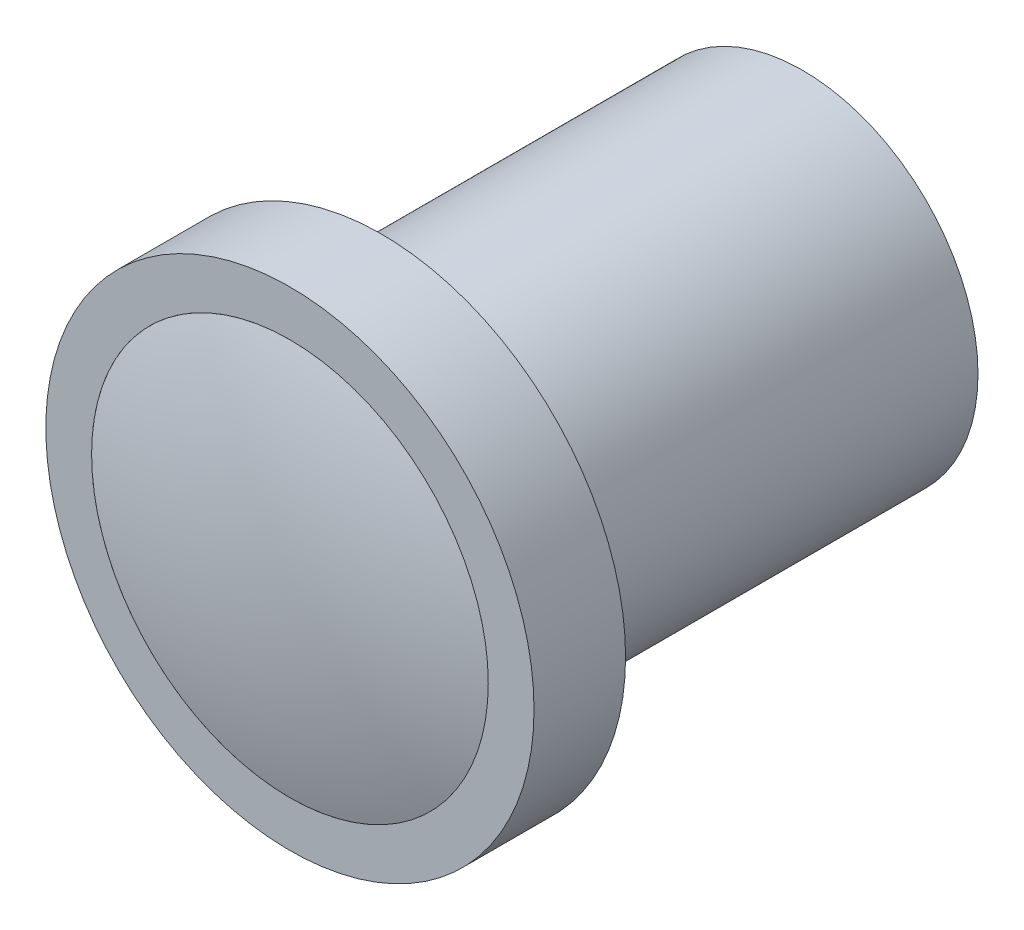
ISO-10303-21;
HEADER;
FILE_DESCRIPTION(('STEP AP214'),'2;1');
FILE_NAME('part.step','',(''),(''),'','','');
FILE_SCHEMA(('AUTOMOTIVE_DESIGN { 1 0 10303 214 1 1 1 1 }'));
ENDSEC;
DATA;
#1=APPLICATION_CONTEXT('core data for automotive mechanical design processes');
#2=APPLICATION_PROTOCOL_DEFINITION('international standard','automotive_design',2000,#1);
#3=PRODUCT_CONTEXT('',#1,'mechanical');
#4=PRODUCT('Part','Part','',(#3));
#5=PRODUCT_RELATED_PRODUCT_CATEGORY('part','',(#4));
#6=PRODUCT_DEFINITION_FORMATION('','',#4);
#7=PRODUCT_DEFINITION_CONTEXT('part definition',#1,'design');
#8=PRODUCT_DEFINITION('design','',#6,#7);
#9=PRODUCT_DEFINITION_SHAPE('','',#8);
#10=(LENGTH_UNIT() NAMED_UNIT(*) SI_UNIT(.MILLI.,.METRE.));
#11=(NAMED_UNIT(*) PLANE_ANGLE_UNIT() SI_UNIT($,.RADIAN.));
#12=(NAMED_UNIT(*) SI_UNIT($,.STERADIAN.) SOLID_ANGLE_UNIT());
#13=UNCERTAINTY_MEASURE_WITH_UNIT(LENGTH_MEASURE(1.E-05),#10,'distance_accuracy_value','');
#14=(GEOMETRIC_REPRESENTATION_CONTEXT(3) GLOBAL_UNCERTAINTY_ASSIGNED_CONTEXT((#13)) GLOBAL_UNIT_ASSIGNED_CONTEXT((#10,
#11,#12)) REPRESENTATION_CONTEXT('',''));
#15=CARTESIAN_POINT('',(0.,0.,0.));
#16=DIRECTION('',(0.,0.,1.));
#17=DIRECTION('',(1.,0.,0.));
#18=AXIS2_PLACEMENT_3D('',#15,#16,#17);
#19=CARTESIAN_POINT('',(0.,0.,14.8));
#20=DIRECTION('',(0.,0.,1.));
#21=DIRECTION('',(1.,0.,0.));
#22=AXIS2_PLACEMENT_3D('',#19,#20,#21);
#23=PLANE('',#22);
#24=CARTESIAN_POINT('',(0.,0.,14.8));
#25=DIRECTION('',(0.,0.,-1.));
#26=DIRECTION('',(-1.,0.,0.));
#27=AXIS2_PLACEMENT_3D('',#24,#25,#26);
#28=CIRCLE('',#27,6.5);
#29=CARTESIAN_POINT('',(-6.5,0.,14.8));
#30=VERTEX_POINT('',#29);
#31=EDGE_CURVE('E49',#30,#30,#28,.T.);
#32=ORIENTED_EDGE('',*,*,#31,.T.);
#33=EDGE_LOOP('',(#32));
#34=FACE_BOUND('',#33,.T.);
#35=ADVANCED_FACE('F43',(#34),#23,.F.);
#36=CARTESIAN_POINT('',(0.,0.,-3.82500000000021));
#37=DIRECTION('',(0.,0.,-1.));
#38=DIRECTION('',(1.,0.,0.));
#39=AXIS2_PLACEMENT_3D('',#36,#37,#38);
#40=SPHERICAL_SURFACE('',#39,21.6250000000002);
#41=CARTESIAN_POINT('',(0.,0.,16.8));
#42=DIRECTION('',(0.,0.,-1.));
#43=DIRECTION('',(-1.,0.,0.));
#44=AXIS2_PLACEMENT_3D('',#41,#42,#43);
#45=CIRCLE('',#44,6.5);
#46=CARTESIAN_POINT('',(-6.5,0.,16.8));
#47=VERTEX_POINT('',#46);
#48=EDGE_CURVE('E11',#47,#47,#45,.T.);
#49=ORIENTED_EDGE('',*,*,#48,.F.);
#50=EDGE_LOOP('',(#49));
#51=FACE_BOUND('',#50,.T.);
#52=ADVANCED_FACE('F58',(#51),#40,.T.);
#53=CARTESIAN_POINT('',(0.,0.,14.8));
#54=DIRECTION('',(0.,0.,-1.));
#55=DIRECTION('',(-1.,0.,0.));
#56=AXIS2_PLACEMENT_3D('',#53,#54,#55);
#57=CYLINDRICAL_SURFACE('',#56,6.5);
#58=ORIENTED_EDGE('',*,*,#31,.F.);
#59=EDGE_LOOP('',(#58));
#60=FACE_BOUND('',#59,.T.);
#61=ORIENTED_EDGE('',*,*,#48,.T.);
#62=EDGE_LOOP('',(#61));
#63=FACE_BOUND('',#62,.T.);
#64=ADVANCED_FACE('F56',(#60,#63),#57,.T.);
#65=CLOSED_SHELL('',(#35,#52,#64));
#66=MANIFOLD_SOLID_BREP('B2',#65);
#67=CARTESIAN_POINT('',(0.,0.,13.8));
#68=DIRECTION('',(0.,0.,-1.));
#69=DIRECTION('',(-1.,0.,0.));
#70=AXIS2_PLACEMENT_3D('',#67,#68,#69);
#71=CYLINDRICAL_SURFACE('',#70,5.75);
#72=CARTESIAN_POINT('',(0.,0.,13.8));
#73=DIRECTION('',(0.,0.,1.));
#74=DIRECTION('',(1.,0.,0.));
#75=AXIS2_PLACEMENT_3D('',#72,#73,#74);
#76=CIRCLE('',#75,5.75);
#77=CARTESIAN_POINT('',(5.75,0.,13.8));
#78=VERTEX_POINT('',#77);
#79=EDGE_CURVE('E42',#78,#78,#76,.T.);
#80=ORIENTED_EDGE('',*,*,#79,.F.);
#81=EDGE_LOOP('',(#80));
#82=FACE_BOUND('',#81,.T.);
#83=CARTESIAN_POINT('',(0.,0.,0.));
#84=DIRECTION('',(0.,0.,1.));
#85=DIRECTION('',(1.,0.,0.));
#86=AXIS2_PLACEMENT_3D('',#83,#84,#85);
#87=CIRCLE('',#86,5.75);
#88=CARTESIAN_POINT('',(5.75,0.,0.));
#89=VERTEX_POINT('',#88);
#90=EDGE_CURVE('E86',#89,#89,#87,.T.);
#91=ORIENTED_EDGE('',*,*,#90,.T.);
#92=EDGE_LOOP('',(#91));
#93=FACE_BOUND('',#92,.T.);
#94=ADVANCED_FACE('F83',(#82,#93),#71,.T.);
#95=CARTESIAN_POINT('',(0.,0.,0.));
#96=DIRECTION('',(0.,0.,1.));
#97=DIRECTION('',(1.,0.,0.));
#98=AXIS2_PLACEMENT_3D('',#95,#96,#97);
#99=PLANE('',#98);
#100=ORIENTED_EDGE('',*,*,#90,.F.);
#101=EDGE_LOOP('',(#100));
#102=FACE_BOUND('',#101,.T.);
#103=ADVANCED_FACE('F125',(#102),#99,.F.);
#104=CARTESIAN_POINT('',(0.,0.,16.8));
#105=DIRECTION('',(0.,0.,-1.));
#106=DIRECTION('',(-1.,0.,0.));
#107=AXIS2_PLACEMENT_3D('',#104,#105,#106);
#108=CYLINDRICAL_SURFACE('',#107,8.);
#109=CARTESIAN_POINT('',(0.,0.,16.8));
#110=DIRECTION('',(0.,0.,1.));
#111=DIRECTION('',(1.,0.,0.));
#112=AXIS2_PLACEMENT_3D('',#109,#110,#111);
#113=CIRCLE('',#112,8.);
#114=CARTESIAN_POINT('',(8.,0.,16.8));
#115=VERTEX_POINT('',#114);
#116=EDGE_CURVE('E93',#115,#115,#113,.T.);
#117=ORIENTED_EDGE('',*,*,#116,.F.);
#118=EDGE_LOOP('',(#117));
#119=FACE_BOUND('',#118,.T.);
#120=CARTESIAN_POINT('',(0.,0.,13.8));
#121=DIRECTION('',(0.,0.,1.));
#122=DIRECTION('',(1.,0.,0.));
#123=AXIS2_PLACEMENT_3D('',#120,#121,#122);
#124=CIRCLE('',#123,8.);
#125=CARTESIAN_POINT('',(8.,0.,13.8));
#126=VERTEX_POINT('',#125);
#127=EDGE_CURVE('E95',#126,#126,#124,.T.);
#128=ORIENTED_EDGE('',*,*,#127,.T.);
#129=EDGE_LOOP('',(#128));
#130=FACE_BOUND('',#129,.T.);
#131=ADVANCED_FACE('F119',(#119,#130),#108,.T.);
#132=CARTESIAN_POINT('',(0.,0.,16.8));
#133=DIRECTION('',(0.,0.,1.));
#134=DIRECTION('',(1.,0.,0.));
#135=AXIS2_PLACEMENT_3D('',#132,#133,#134);
#136=PLANE('',#135);
#137=CARTESIAN_POINT('',(0.,0.,16.8));
#138=DIRECTION('',(0.,0.,1.));
#139=DIRECTION('',(1.,0.,0.));
#140=AXIS2_PLACEMENT_3D('',#137,#138,#139);
#141=CIRCLE('',#140,6.5);
#142=CARTESIAN_POINT('',(6.5,0.,16.8));
#143=VERTEX_POINT('',#142);
#144=EDGE_CURVE('E101',#143,#143,#141,.T.);
#145=ORIENTED_EDGE('',*,*,#144,.F.);
#146=EDGE_LOOP('',(#145));
#147=FACE_BOUND('',#146,.T.);
#148=ORIENTED_EDGE('',*,*,#116,.T.);
#149=EDGE_LOOP('',(#148));
#150=FACE_BOUND('',#149,.T.);
#151=ADVANCED_FACE('F116',(#147,#150),#136,.T.);
#152=CARTESIAN_POINT('',(0.,0.,13.8));
#153=DIRECTION('',(0.,0.,1.));
#154=DIRECTION('',(1.,0.,0.));
#155=AXIS2_PLACEMENT_3D('',#152,#153,#154);
#156=PLANE('',#155);
#157=ORIENTED_EDGE('',*,*,#79,.T.);
#158=EDGE_LOOP('',(#157));
#159=FACE_BOUND('',#158,.T.);
#160=ORIENTED_EDGE('',*,*,#127,.F.);
#161=EDGE_LOOP('',(#160));
#162=FACE_BOUND('',#161,.T.);
#163=ADVANCED_FACE('F112',(#159,#162),#156,.F.);
#164=CARTESIAN_POINT('',(0.,0.,14.8));
#165=DIRECTION('',(0.,0.,1.));
#166=DIRECTION('',(1.,0.,0.));
#167=AXIS2_PLACEMENT_3D('',#164,#165,#166);
#168=CYLINDRICAL_SURFACE('',#167,6.5);
#169=CARTESIAN_POINT('',(0.,0.,14.8));
#170=DIRECTION('',(0.,0.,1.));
#171=DIRECTION('',(1.,0.,0.));
#172=AXIS2_PLACEMENT_3D('',#169,#170,#171);
#173=CIRCLE('',#172,6.5);
#174=CARTESIAN_POINT('',(6.5,0.,14.8));
#175=VERTEX_POINT('',#174);
#176=EDGE_CURVE('E98',#175,#175,#173,.T.);
#177=ORIENTED_EDGE('',*,*,#176,.F.);
#178=EDGE_LOOP('',(#177));
#179=FACE_BOUND('',#178,.T.);
#180=ORIENTED_EDGE('',*,*,#144,.T.);
#181=EDGE_LOOP('',(#180));
#182=FACE_BOUND('',#181,.T.);
#183=ADVANCED_FACE('F109',(#179,#182),#168,.F.);
#184=CARTESIAN_POINT('',(0.,0.,14.8));
#185=DIRECTION('',(0.,0.,1.));
#186=DIRECTION('',(1.,0.,0.));
#187=AXIS2_PLACEMENT_3D('',#184,#185,#186);
#188=PLANE('',#187);
#189=ORIENTED_EDGE('',*,*,#176,.T.);
#190=EDGE_LOOP('',(#189));
#191=FACE_BOUND('',#190,.T.);
#192=ADVANCED_FACE('F107',(#191),#188,.T.);
#193=CLOSED_SHELL('',(#94,#103,#131,#151,#163,#183,#192));
#194=MANIFOLD_SOLID_BREP('B6',#193);
#195=ADVANCED_BREP_SHAPE_REPRESENTATION('',(#18,#66,#194),#14);
#196=SHAPE_DEFINITION_REPRESENTATION(#9,#195);
ENDSEC;
END-ISO-10303-21;
